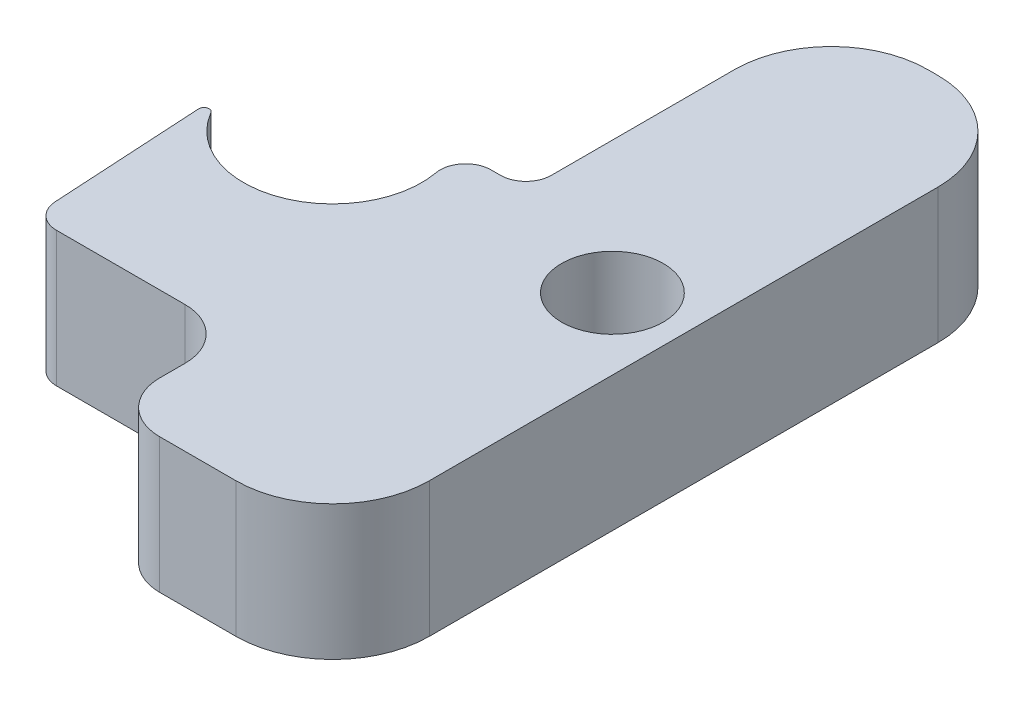
ISO-10303-21;
HEADER;
FILE_DESCRIPTION(('STEP AP214'),'2;1');
FILE_NAME('part.step','',(''),(''),'','','');
FILE_SCHEMA(('AUTOMOTIVE_DESIGN { 1 0 10303 214 1 1 1 1 }'));
ENDSEC;
DATA;
#1=APPLICATION_CONTEXT('core data for automotive mechanical design processes');
#2=APPLICATION_PROTOCOL_DEFINITION('international standard','automotive_design',2000,#1);
#3=PRODUCT_CONTEXT('',#1,'mechanical');
#4=PRODUCT('Part','Part','',(#3));
#5=PRODUCT_RELATED_PRODUCT_CATEGORY('part','',(#4));
#6=PRODUCT_DEFINITION_FORMATION('','',#4);
#7=PRODUCT_DEFINITION_CONTEXT('part definition',#1,'design');
#8=PRODUCT_DEFINITION('design','',#6,#7);
#9=PRODUCT_DEFINITION_SHAPE('','',#8);
#10=(LENGTH_UNIT() NAMED_UNIT(*) SI_UNIT(.MILLI.,.METRE.));
#11=(NAMED_UNIT(*) PLANE_ANGLE_UNIT() SI_UNIT($,.RADIAN.));
#12=(NAMED_UNIT(*) SI_UNIT($,.STERADIAN.) SOLID_ANGLE_UNIT());
#13=UNCERTAINTY_MEASURE_WITH_UNIT(LENGTH_MEASURE(1.E-05),#10,'distance_accuracy_value','');
#14=(GEOMETRIC_REPRESENTATION_CONTEXT(3) GLOBAL_UNCERTAINTY_ASSIGNED_CONTEXT((#13)) GLOBAL_UNIT_ASSIGNED_CONTEXT((#10,
#11,#12)) REPRESENTATION_CONTEXT('',''));
#15=CARTESIAN_POINT('',(0.,0.,0.));
#16=DIRECTION('',(0.,0.,1.));
#17=DIRECTION('',(1.,0.,0.));
#18=AXIS2_PLACEMENT_3D('',#15,#16,#17);
#19=CARTESIAN_POINT('',(0.,2.65,0.));
#20=DIRECTION('',(0.,-1.,0.));
#21=DIRECTION('',(0.,0.,-1.));
#22=AXIS2_PLACEMENT_3D('',#19,#20,#21);
#23=CYLINDRICAL_SURFACE('',#22,1.75);
#24=CARTESIAN_POINT('',(0.,0.,0.));
#25=DIRECTION('',(0.,1.,0.));
#26=DIRECTION('',(0.,0.,1.));
#27=AXIS2_PLACEMENT_3D('',#24,#25,#26);
#28=CIRCLE('',#27,1.75);
#29=CARTESIAN_POINT('',(-1.51282681163303,0.,0.879690308008579));
#30=VERTEX_POINT('',#29);
#31=CARTESIAN_POINT('',(1.72212365309324,0.,-0.311111111111111));
#32=VERTEX_POINT('',#31);
#33=EDGE_CURVE('E259',#30,#32,#28,.T.);
#34=ORIENTED_EDGE('',*,*,#33,.F.);
#35=DIRECTION('',(0.,-1.,0.));
#36=VECTOR('',#35,1.);
#37=CARTESIAN_POINT('',(-1.51282681163303,2.65,0.879690308008579));
#38=LINE('',#37,#36);
#39=CARTESIAN_POINT('',(-1.51282681163303,2.65,0.879690308008579));
#40=VERTEX_POINT('',#39);
#41=EDGE_CURVE('E11',#40,#30,#38,.T.);
#42=ORIENTED_EDGE('',*,*,#41,.F.);
#43=CARTESIAN_POINT('',(0.,2.65,0.));
#44=DIRECTION('',(0.,1.,0.));
#45=DIRECTION('',(0.,0.,1.));
#46=AXIS2_PLACEMENT_3D('',#43,#44,#45);
#47=CIRCLE('',#46,1.75);
#48=CARTESIAN_POINT('',(1.72212365309324,2.65,-0.311111111111111));
#49=VERTEX_POINT('',#48);
#50=EDGE_CURVE('E568',#40,#49,#47,.T.);
#51=ORIENTED_EDGE('',*,*,#50,.T.);
#52=DIRECTION('',(0.,-1.,0.));
#53=VECTOR('',#52,1.);
#54=CARTESIAN_POINT('',(1.72212365309324,2.65,-0.311111111111111));
#55=LINE('',#54,#53);
#56=EDGE_CURVE('E59',#49,#32,#55,.T.);
#57=ORIENTED_EDGE('',*,*,#56,.T.);
#58=EDGE_LOOP('',(#34,#42,#51,#57));
#59=FACE_BOUND('',#58,.T.);
#60=ADVANCED_FACE('F41',(#59),#23,.F.);
#61=CARTESIAN_POINT('',(-1.59927405801206,2.65,0.92995832560907));
#62=DIRECTION('',(0.,-1.,0.));
#63=DIRECTION('',(0.,0.,-1.));
#64=AXIS2_PLACEMENT_3D('',#61,#62,#63);
#65=CYLINDRICAL_SURFACE('',#64,0.1);
#66=CARTESIAN_POINT('',(-1.59927405801206,0.,0.92995832560907));
#67=DIRECTION('',(0.,1.,0.));
#68=DIRECTION('',(0.,0.,1.));
#69=AXIS2_PLACEMENT_3D('',#66,#67,#68);
#70=CIRCLE('',#69,0.1);
#71=CARTESIAN_POINT('',(-1.69910929988495,0.,0.935696311334222));
#72=VERTEX_POINT('',#71);
#73=EDGE_CURVE('E255',#30,#72,#70,.T.);
#74=ORIENTED_EDGE('',*,*,#73,.T.);
#75=DIRECTION('',(0.,-1.,0.));
#76=VECTOR('',#75,1.);
#77=CARTESIAN_POINT('',(-1.69910929988495,2.65,0.935696311334222));
#78=LINE('',#77,#76);
#79=CARTESIAN_POINT('',(-1.69910929988495,2.65,0.935696311334222));
#80=VERTEX_POINT('',#79);
#81=EDGE_CURVE('E51',#80,#72,#78,.T.);
#82=ORIENTED_EDGE('',*,*,#81,.F.);
#83=CARTESIAN_POINT('',(-1.59927405801206,2.65,0.92995832560907));
#84=DIRECTION('',(0.,1.,0.));
#85=DIRECTION('',(0.,0.,1.));
#86=AXIS2_PLACEMENT_3D('',#83,#84,#85);
#87=CIRCLE('',#86,0.1);
#88=EDGE_CURVE('E562',#40,#80,#87,.T.);
#89=ORIENTED_EDGE('',*,*,#88,.F.);
#90=ORIENTED_EDGE('',*,*,#41,.T.);
#91=EDGE_LOOP('',(#74,#82,#89,#90));
#92=FACE_BOUND('',#91,.T.);
#93=ADVANCED_FACE('F256',(#92),#65,.T.);
#94=CARTESIAN_POINT('',(-1.74711673277553,2.65,0.10041475019016));
#95=DIRECTION('',(-0.998352418728875,0.,0.0573798572515198));
#96=DIRECTION('',(0.0573798572515198,0.,0.998352418728875));
#97=AXIS2_PLACEMENT_3D('',#94,#95,#96);
#98=PLANE('',#97);
#99=DIRECTION('',(-0.0573798572515198,0.,-0.998352418728875));
#100=VECTOR('',#99,1.);
#101=CARTESIAN_POINT('',(-1.74711673277553,0.,0.10041475019016));
#102=LINE('',#101,#100);
#103=CARTESIAN_POINT('',(-1.52708833484982,0.,3.92868992862576));
#104=VERTEX_POINT('',#103);
#105=EDGE_CURVE('E249',#104,#72,#102,.T.);
#106=ORIENTED_EDGE('',*,*,#105,.F.);
#107=DIRECTION('',(0.,-1.,0.));
#108=VECTOR('',#107,1.);
#109=CARTESIAN_POINT('',(-1.52708833484982,2.65,3.92868992862576));
#110=LINE('',#109,#108);
#111=CARTESIAN_POINT('',(-1.52708833484982,2.65,3.92868992862576));
#112=VERTEX_POINT('',#111);
#113=EDGE_CURVE('E239',#112,#104,#110,.T.);
#114=ORIENTED_EDGE('',*,*,#113,.F.);
#115=DIRECTION('',(-0.0573798572515198,0.,-0.998352418728875));
#116=VECTOR('',#115,1.);
#117=CARTESIAN_POINT('',(-1.74711673277553,2.65,0.10041475019016));
#118=LINE('',#117,#116);
#119=EDGE_CURVE('E252',#112,#80,#118,.T.);
#120=ORIENTED_EDGE('',*,*,#119,.T.);
#121=ORIENTED_EDGE('',*,*,#81,.T.);
#122=EDGE_LOOP('',(#106,#114,#120,#121));
#123=FACE_BOUND('',#122,.T.);
#124=ADVANCED_FACE('F247',(#123),#98,.T.);
#125=CARTESIAN_POINT('',(-1.02791212548538,2.65,3.9));
#126=DIRECTION('',(0.,-1.,0.));
#127=DIRECTION('',(0.,0.,-1.));
#128=AXIS2_PLACEMENT_3D('',#125,#126,#127);
#129=CYLINDRICAL_SURFACE('',#128,0.5);
#130=CARTESIAN_POINT('',(-1.02791212548538,0.,3.9));
#131=DIRECTION('',(0.,1.,0.));
#132=DIRECTION('',(0.,0.,1.));
#133=AXIS2_PLACEMENT_3D('',#130,#131,#132);
#134=CIRCLE('',#133,0.5);
#135=CARTESIAN_POINT('',(-1.02791212548538,0.,4.4));
#136=VERTEX_POINT('',#135);
#137=EDGE_CURVE('E264',#136,#104,#134,.F.);
#138=ORIENTED_EDGE('',*,*,#137,.F.);
#139=DIRECTION('',(0.,-1.,0.));
#140=VECTOR('',#139,1.);
#141=CARTESIAN_POINT('',(-1.02791212548538,2.65,4.4));
#142=LINE('',#141,#140);
#143=CARTESIAN_POINT('',(-1.02791212548538,2.65,4.4));
#144=VERTEX_POINT('',#143);
#145=EDGE_CURVE('E236',#144,#136,#142,.T.);
#146=ORIENTED_EDGE('',*,*,#145,.F.);
#147=CARTESIAN_POINT('',(-1.02791212548538,2.65,3.9));
#148=DIRECTION('',(0.,1.,0.));
#149=DIRECTION('',(0.,0.,1.));
#150=AXIS2_PLACEMENT_3D('',#147,#148,#149);
#151=CIRCLE('',#150,0.5);
#152=EDGE_CURVE('E561',#144,#112,#151,.F.);
#153=ORIENTED_EDGE('',*,*,#152,.T.);
#154=ORIENTED_EDGE('',*,*,#113,.T.);
#155=EDGE_LOOP('',(#138,#146,#153,#154));
#156=FACE_BOUND('',#155,.T.);
#157=ADVANCED_FACE('F352',(#156),#129,.T.);
#158=CARTESIAN_POINT('',(0.,2.65,4.4));
#159=DIRECTION('',(0.,0.,-1.));
#160=DIRECTION('',(-1.,0.,0.));
#161=AXIS2_PLACEMENT_3D('',#158,#159,#160);
#162=PLANE('',#161);
#163=DIRECTION('',(1.,0.,0.));
#164=VECTOR('',#163,1.);
#165=CARTESIAN_POINT('',(0.,0.,4.4));
#166=LINE('',#165,#164);
#167=CARTESIAN_POINT('',(1.49999999999999,0.,4.4));
#168=VERTEX_POINT('',#167);
#169=EDGE_CURVE('E268',#136,#168,#166,.T.);
#170=ORIENTED_EDGE('',*,*,#169,.T.);
#171=DIRECTION('',(0.,-1.,0.));
#172=VECTOR('',#171,1.);
#173=CARTESIAN_POINT('',(1.49999999999999,2.65,4.4));
#174=LINE('',#173,#172);
#175=CARTESIAN_POINT('',(1.49999999999999,2.65,4.4));
#176=VERTEX_POINT('',#175);
#177=EDGE_CURVE('E232',#176,#168,#174,.T.);
#178=ORIENTED_EDGE('',*,*,#177,.F.);
#179=DIRECTION('',(1.,0.,0.));
#180=VECTOR('',#179,1.);
#181=CARTESIAN_POINT('',(0.,2.65,4.4));
#182=LINE('',#181,#180);
#183=EDGE_CURVE('E558',#144,#176,#182,.T.);
#184=ORIENTED_EDGE('',*,*,#183,.F.);
#185=ORIENTED_EDGE('',*,*,#145,.T.);
#186=EDGE_LOOP('',(#170,#178,#184,#185));
#187=FACE_BOUND('',#186,.T.);
#188=ADVANCED_FACE('F355',(#187),#162,.F.);
#189=CARTESIAN_POINT('',(1.5,2.65,5.4));
#190=DIRECTION('',(0.,-1.,0.));
#191=DIRECTION('',(0.,0.,-1.));
#192=AXIS2_PLACEMENT_3D('',#189,#190,#191);
#193=CYLINDRICAL_SURFACE('',#192,1.);
#194=CARTESIAN_POINT('',(1.5,0.,5.4));
#195=DIRECTION('',(0.,1.,0.));
#196=DIRECTION('',(0.,0.,1.));
#197=AXIS2_PLACEMENT_3D('',#194,#195,#196);
#198=CIRCLE('',#197,1.);
#199=CARTESIAN_POINT('',(2.5,0.,5.40000000000001));
#200=VERTEX_POINT('',#199);
#201=EDGE_CURVE('E275',#168,#200,#198,.F.);
#202=ORIENTED_EDGE('',*,*,#201,.T.);
#203=DIRECTION('',(0.,-1.,0.));
#204=VECTOR('',#203,1.);
#205=CARTESIAN_POINT('',(2.5,2.65,5.40000000000001));
#206=LINE('',#205,#204);
#207=CARTESIAN_POINT('',(2.5,2.65,5.40000000000001));
#208=VERTEX_POINT('',#207);
#209=EDGE_CURVE('E228',#208,#200,#206,.T.);
#210=ORIENTED_EDGE('',*,*,#209,.F.);
#211=CARTESIAN_POINT('',(1.5,2.65,5.4));
#212=DIRECTION('',(0.,1.,0.));
#213=DIRECTION('',(0.,0.,1.));
#214=AXIS2_PLACEMENT_3D('',#211,#212,#213);
#215=CIRCLE('',#214,1.);
#216=EDGE_CURVE('E555',#176,#208,#215,.F.);
#217=ORIENTED_EDGE('',*,*,#216,.F.);
#218=ORIENTED_EDGE('',*,*,#177,.T.);
#219=EDGE_LOOP('',(#202,#210,#217,#218));
#220=FACE_BOUND('',#219,.T.);
#221=ADVANCED_FACE('F359',(#220),#193,.F.);
#222=CARTESIAN_POINT('',(2.5,2.65,0.));
#223=DIRECTION('',(1.,0.,0.));
#224=DIRECTION('',(0.,0.,-1.));
#225=AXIS2_PLACEMENT_3D('',#222,#223,#224);
#226=PLANE('',#225);
#227=DIRECTION('',(0.,0.,1.));
#228=VECTOR('',#227,1.);
#229=CARTESIAN_POINT('',(2.5,0.,0.));
#230=LINE('',#229,#228);
#231=CARTESIAN_POINT('',(2.5,0.,5.9));
#232=VERTEX_POINT('',#231);
#233=EDGE_CURVE('E279',#200,#232,#230,.T.);
#234=ORIENTED_EDGE('',*,*,#233,.T.);
#235=DIRECTION('',(0.,-1.,0.));
#236=VECTOR('',#235,1.);
#237=CARTESIAN_POINT('',(2.5,2.65,5.9));
#238=LINE('',#237,#236);
#239=CARTESIAN_POINT('',(2.5,2.65,5.9));
#240=VERTEX_POINT('',#239);
#241=EDGE_CURVE('E225',#240,#232,#238,.T.);
#242=ORIENTED_EDGE('',*,*,#241,.F.);
#243=DIRECTION('',(0.,0.,1.));
#244=VECTOR('',#243,1.);
#245=CARTESIAN_POINT('',(2.5,2.65,0.));
#246=LINE('',#245,#244);
#247=EDGE_CURVE('E576',#208,#240,#246,.T.);
#248=ORIENTED_EDGE('',*,*,#247,.F.);
#249=ORIENTED_EDGE('',*,*,#209,.T.);
#250=EDGE_LOOP('',(#234,#242,#248,#249));
#251=FACE_BOUND('',#250,.T.);
#252=ADVANCED_FACE('F363',(#251),#226,.F.);
#253=CARTESIAN_POINT('',(3.5,2.65,5.9));
#254=DIRECTION('',(0.,-1.,0.));
#255=DIRECTION('',(0.,0.,-1.));
#256=AXIS2_PLACEMENT_3D('',#253,#254,#255);
#257=CYLINDRICAL_SURFACE('',#256,1.);
#258=CARTESIAN_POINT('',(3.5,0.,5.9));
#259=DIRECTION('',(0.,1.,0.));
#260=DIRECTION('',(0.,0.,1.));
#261=AXIS2_PLACEMENT_3D('',#258,#259,#260);
#262=CIRCLE('',#261,1.);
#263=CARTESIAN_POINT('',(3.50000000000001,0.,6.9));
#264=VERTEX_POINT('',#263);
#265=EDGE_CURVE('E283',#264,#232,#262,.F.);
#266=ORIENTED_EDGE('',*,*,#265,.F.);
#267=DIRECTION('',(0.,-1.,0.));
#268=VECTOR('',#267,1.);
#269=CARTESIAN_POINT('',(3.50000000000001,2.65,6.9));
#270=LINE('',#269,#268);
#271=CARTESIAN_POINT('',(3.50000000000001,2.65,6.9));
#272=VERTEX_POINT('',#271);
#273=EDGE_CURVE('E222',#272,#264,#270,.T.);
#274=ORIENTED_EDGE('',*,*,#273,.F.);
#275=CARTESIAN_POINT('',(3.5,2.65,5.9));
#276=DIRECTION('',(0.,1.,0.));
#277=DIRECTION('',(0.,0.,1.));
#278=AXIS2_PLACEMENT_3D('',#275,#276,#277);
#279=CIRCLE('',#278,1.);
#280=EDGE_CURVE('E551',#272,#240,#279,.F.);
#281=ORIENTED_EDGE('',*,*,#280,.T.);
#282=ORIENTED_EDGE('',*,*,#241,.T.);
#283=EDGE_LOOP('',(#266,#274,#281,#282));
#284=FACE_BOUND('',#283,.T.);
#285=ADVANCED_FACE('F367',(#284),#257,.T.);
#286=CARTESIAN_POINT('',(0.,2.65,6.9));
#287=DIRECTION('',(0.,0.,-1.));
#288=DIRECTION('',(-1.,0.,0.));
#289=AXIS2_PLACEMENT_3D('',#286,#287,#288);
#290=PLANE('',#289);
#291=DIRECTION('',(1.,0.,0.));
#292=VECTOR('',#291,1.);
#293=CARTESIAN_POINT('',(0.,0.,6.9));
#294=LINE('',#293,#292);
#295=CARTESIAN_POINT('',(4.99999999999999,0.,6.9));
#296=VERTEX_POINT('',#295);
#297=EDGE_CURVE('E287',#264,#296,#294,.T.);
#298=ORIENTED_EDGE('',*,*,#297,.T.);
#299=DIRECTION('',(0.,-1.,0.));
#300=VECTOR('',#299,1.);
#301=CARTESIAN_POINT('',(4.99999999999999,2.65,6.9));
#302=LINE('',#301,#300);
#303=CARTESIAN_POINT('',(4.99999999999999,2.65,6.9));
#304=VERTEX_POINT('',#303);
#305=EDGE_CURVE('E218',#304,#296,#302,.T.);
#306=ORIENTED_EDGE('',*,*,#305,.F.);
#307=DIRECTION('',(1.,0.,0.));
#308=VECTOR('',#307,1.);
#309=CARTESIAN_POINT('',(0.,2.65,6.9));
#310=LINE('',#309,#308);
#311=EDGE_CURVE('E581',#272,#304,#310,.T.);
#312=ORIENTED_EDGE('',*,*,#311,.F.);
#313=ORIENTED_EDGE('',*,*,#273,.T.);
#314=EDGE_LOOP('',(#298,#306,#312,#313));
#315=FACE_BOUND('',#314,.T.);
#316=ADVANCED_FACE('F371',(#315),#290,.F.);
#317=CARTESIAN_POINT('',(5.,2.65,5.));
#318=DIRECTION('',(0.,-1.,0.));
#319=DIRECTION('',(0.,0.,-1.));
#320=AXIS2_PLACEMENT_3D('',#317,#318,#319);
#321=CYLINDRICAL_SURFACE('',#320,1.9);
#322=CARTESIAN_POINT('',(5.,0.,5.));
#323=DIRECTION('',(0.,1.,0.));
#324=DIRECTION('',(0.,0.,1.));
#325=AXIS2_PLACEMENT_3D('',#322,#323,#324);
#326=CIRCLE('',#325,1.9);
#327=CARTESIAN_POINT('',(6.9,0.,4.99999999999999));
#328=VERTEX_POINT('',#327);
#329=EDGE_CURVE('E291',#296,#328,#326,.T.);
#330=ORIENTED_EDGE('',*,*,#329,.T.);
#331=DIRECTION('',(0.,-1.,0.));
#332=VECTOR('',#331,1.);
#333=CARTESIAN_POINT('',(6.9,2.65,4.99999999999999));
#334=LINE('',#333,#332);
#335=CARTESIAN_POINT('',(6.9,2.65,4.99999999999999));
#336=VERTEX_POINT('',#335);
#337=EDGE_CURVE('E215',#336,#328,#334,.T.);
#338=ORIENTED_EDGE('',*,*,#337,.F.);
#339=CARTESIAN_POINT('',(5.,2.65,5.));
#340=DIRECTION('',(0.,1.,0.));
#341=DIRECTION('',(0.,0.,1.));
#342=AXIS2_PLACEMENT_3D('',#339,#340,#341);
#343=CIRCLE('',#342,1.9);
#344=EDGE_CURVE('E585',#304,#336,#343,.T.);
#345=ORIENTED_EDGE('',*,*,#344,.F.);
#346=ORIENTED_EDGE('',*,*,#305,.T.);
#347=EDGE_LOOP('',(#330,#338,#345,#346));
#348=FACE_BOUND('',#347,.T.);
#349=ADVANCED_FACE('F375',(#348),#321,.T.);
#350=CARTESIAN_POINT('',(6.9,2.65,0.));
#351=DIRECTION('',(1.,0.,0.));
#352=DIRECTION('',(0.,0.,-1.));
#353=AXIS2_PLACEMENT_3D('',#350,#351,#352);
#354=PLANE('',#353);
#355=DIRECTION('',(0.,0.,1.));
#356=VECTOR('',#355,1.);
#357=CARTESIAN_POINT('',(6.9,0.,0.));
#358=LINE('',#357,#356);
#359=CARTESIAN_POINT('',(6.9,0.,-4.99999999999999));
#360=VERTEX_POINT('',#359);
#361=EDGE_CURVE('E295',#360,#328,#358,.T.);
#362=ORIENTED_EDGE('',*,*,#361,.F.);
#363=DIRECTION('',(0.,-1.,0.));
#364=VECTOR('',#363,1.);
#365=CARTESIAN_POINT('',(6.9,2.65,-4.99999999999999));
#366=LINE('',#365,#364);
#367=CARTESIAN_POINT('',(6.9,2.65,-4.99999999999999));
#368=VERTEX_POINT('',#367);
#369=EDGE_CURVE('E212',#368,#360,#366,.T.);
#370=ORIENTED_EDGE('',*,*,#369,.F.);
#371=DIRECTION('',(0.,0.,1.));
#372=VECTOR('',#371,1.);
#373=CARTESIAN_POINT('',(6.9,2.65,0.));
#374=LINE('',#373,#372);
#375=EDGE_CURVE('E543',#368,#336,#374,.T.);
#376=ORIENTED_EDGE('',*,*,#375,.T.);
#377=ORIENTED_EDGE('',*,*,#337,.T.);
#378=EDGE_LOOP('',(#362,#370,#376,#377));
#379=FACE_BOUND('',#378,.T.);
#380=ADVANCED_FACE('F379',(#379),#354,.T.);
#381=CARTESIAN_POINT('',(5.,2.65,-5.));
#382=DIRECTION('',(0.,-1.,0.));
#383=DIRECTION('',(0.,0.,-1.));
#384=AXIS2_PLACEMENT_3D('',#381,#382,#383);
#385=CYLINDRICAL_SURFACE('',#384,1.9);
#386=CARTESIAN_POINT('',(5.,0.,-5.));
#387=DIRECTION('',(0.,1.,0.));
#388=DIRECTION('',(0.,0.,1.));
#389=AXIS2_PLACEMENT_3D('',#386,#387,#388);
#390=CIRCLE('',#389,1.9);
#391=CARTESIAN_POINT('',(4.99999999999999,0.,-6.9));
#392=VERTEX_POINT('',#391);
#393=EDGE_CURVE('E299',#392,#360,#390,.F.);
#394=ORIENTED_EDGE('',*,*,#393,.F.);
#395=DIRECTION('',(0.,-1.,0.));
#396=VECTOR('',#395,1.);
#397=CARTESIAN_POINT('',(4.99999999999999,2.65,-6.9));
#398=LINE('',#397,#396);
#399=CARTESIAN_POINT('',(4.99999999999999,2.65,-6.9));
#400=VERTEX_POINT('',#399);
#401=EDGE_CURVE('E209',#400,#392,#398,.T.);
#402=ORIENTED_EDGE('',*,*,#401,.F.);
#403=CARTESIAN_POINT('',(5.,2.65,-5.));
#404=DIRECTION('',(0.,1.,0.));
#405=DIRECTION('',(0.,0.,1.));
#406=AXIS2_PLACEMENT_3D('',#403,#404,#405);
#407=CIRCLE('',#406,1.9);
#408=EDGE_CURVE('E539',#400,#368,#407,.F.);
#409=ORIENTED_EDGE('',*,*,#408,.T.);
#410=ORIENTED_EDGE('',*,*,#369,.T.);
#411=EDGE_LOOP('',(#394,#402,#409,#410));
#412=FACE_BOUND('',#411,.T.);
#413=ADVANCED_FACE('F383',(#412),#385,.T.);
#414=CARTESIAN_POINT('',(0.,2.65,-6.9));
#415=DIRECTION('',(0.,0.,-1.));
#416=DIRECTION('',(-1.,0.,0.));
#417=AXIS2_PLACEMENT_3D('',#414,#415,#416);
#418=PLANE('',#417);
#419=DIRECTION('',(1.,0.,0.));
#420=VECTOR('',#419,1.);
#421=CARTESIAN_POINT('',(0.,0.,-6.9));
#422=LINE('',#421,#420);
#423=CARTESIAN_POINT('',(4.80000000000001,0.,-6.9));
#424=VERTEX_POINT('',#423);
#425=EDGE_CURVE('E303',#424,#392,#422,.T.);
#426=ORIENTED_EDGE('',*,*,#425,.F.);
#427=DIRECTION('',(0.,-1.,0.));
#428=VECTOR('',#427,1.);
#429=CARTESIAN_POINT('',(4.80000000000001,2.65,-6.9));
#430=LINE('',#429,#428);
#431=CARTESIAN_POINT('',(4.80000000000001,2.65,-6.9));
#432=VERTEX_POINT('',#431);
#433=EDGE_CURVE('E206',#432,#424,#430,.T.);
#434=ORIENTED_EDGE('',*,*,#433,.F.);
#435=DIRECTION('',(1.,0.,0.));
#436=VECTOR('',#435,1.);
#437=CARTESIAN_POINT('',(0.,2.65,-6.9));
#438=LINE('',#437,#436);
#439=EDGE_CURVE('E592',#432,#400,#438,.T.);
#440=ORIENTED_EDGE('',*,*,#439,.T.);
#441=ORIENTED_EDGE('',*,*,#401,.T.);
#442=EDGE_LOOP('',(#426,#434,#440,#441));
#443=FACE_BOUND('',#442,.T.);
#444=ADVANCED_FACE('F387',(#443),#418,.T.);
#445=CARTESIAN_POINT('',(4.8,2.65,-5.));
#446=DIRECTION('',(0.,-1.,0.));
#447=DIRECTION('',(0.,0.,-1.));
#448=AXIS2_PLACEMENT_3D('',#445,#446,#447);
#449=CYLINDRICAL_SURFACE('',#448,1.9);
#450=CARTESIAN_POINT('',(4.8,0.,-5.));
#451=DIRECTION('',(0.,1.,0.));
#452=DIRECTION('',(0.,0.,1.));
#453=AXIS2_PLACEMENT_3D('',#450,#451,#452);
#454=CIRCLE('',#453,1.9);
#455=CARTESIAN_POINT('',(2.9,0.,-4.99999999999999));
#456=VERTEX_POINT('',#455);
#457=EDGE_CURVE('E307',#456,#424,#454,.F.);
#458=ORIENTED_EDGE('',*,*,#457,.F.);
#459=DIRECTION('',(0.,-1.,0.));
#460=VECTOR('',#459,1.);
#461=CARTESIAN_POINT('',(2.9,2.65,-4.99999999999999));
#462=LINE('',#461,#460);
#463=CARTESIAN_POINT('',(2.9,2.65,-4.99999999999999));
#464=VERTEX_POINT('',#463);
#465=EDGE_CURVE('E199',#464,#456,#462,.T.);
#466=ORIENTED_EDGE('',*,*,#465,.F.);
#467=CARTESIAN_POINT('',(4.8,2.65,-5.));
#468=DIRECTION('',(0.,1.,0.));
#469=DIRECTION('',(0.,0.,1.));
#470=AXIS2_PLACEMENT_3D('',#467,#468,#469);
#471=CIRCLE('',#470,1.9);
#472=EDGE_CURVE('E532',#464,#432,#471,.F.);
#473=ORIENTED_EDGE('',*,*,#472,.T.);
#474=ORIENTED_EDGE('',*,*,#433,.T.);
#475=EDGE_LOOP('',(#458,#466,#473,#474));
#476=FACE_BOUND('',#475,.T.);
#477=ADVANCED_FACE('F391',(#476),#449,.T.);
#478=CARTESIAN_POINT('',(2.9,2.65,0.));
#479=DIRECTION('',(1.,0.,0.));
#480=DIRECTION('',(0.,0.,-1.));
#481=AXIS2_PLACEMENT_3D('',#478,#479,#480);
#482=PLANE('',#481);
#483=DIRECTION('',(0.,0.,1.));
#484=VECTOR('',#483,1.);
#485=CARTESIAN_POINT('',(2.9,0.,0.));
#486=LINE('',#485,#484);
#487=CARTESIAN_POINT('',(2.9,0.,-1.4));
#488=VERTEX_POINT('',#487);
#489=EDGE_CURVE('E311',#456,#488,#486,.T.);
#490=ORIENTED_EDGE('',*,*,#489,.T.);
#491=DIRECTION('',(0.,-1.,0.));
#492=VECTOR('',#491,1.);
#493=CARTESIAN_POINT('',(2.9,2.65,-1.4));
#494=LINE('',#493,#492);
#495=CARTESIAN_POINT('',(2.9,2.65,-1.4));
#496=VERTEX_POINT('',#495);
#497=EDGE_CURVE('E195',#496,#488,#494,.T.);
#498=ORIENTED_EDGE('',*,*,#497,.F.);
#499=DIRECTION('',(0.,0.,1.));
#500=VECTOR('',#499,1.);
#501=CARTESIAN_POINT('',(2.9,2.65,0.));
#502=LINE('',#501,#500);
#503=EDGE_CURVE('E186',#464,#496,#502,.T.);
#504=ORIENTED_EDGE('',*,*,#503,.F.);
#505=ORIENTED_EDGE('',*,*,#465,.T.);
#506=EDGE_LOOP('',(#490,#498,#504,#505));
#507=FACE_BOUND('',#506,.T.);
#508=ADVANCED_FACE('F395',(#507),#482,.F.);
#509=CARTESIAN_POINT('',(2.4,2.65,-1.4));
#510=DIRECTION('',(0.,-1.,0.));
#511=DIRECTION('',(0.,0.,-1.));
#512=AXIS2_PLACEMENT_3D('',#509,#510,#511);
#513=CYLINDRICAL_SURFACE('',#512,0.5);
#514=CARTESIAN_POINT('',(2.4,0.,-1.4));
#515=DIRECTION('',(0.,1.,0.));
#516=DIRECTION('',(0.,0.,1.));
#517=AXIS2_PLACEMENT_3D('',#514,#515,#516);
#518=CIRCLE('',#517,0.5);
#519=CARTESIAN_POINT('',(2.4,0.,-0.899999999999999));
#520=VERTEX_POINT('',#519);
#521=EDGE_CURVE('E193',#488,#520,#518,.F.);
#522=ORIENTED_EDGE('',*,*,#521,.T.);
#523=DIRECTION('',(0.,-1.,0.));
#524=VECTOR('',#523,1.);
#525=CARTESIAN_POINT('',(2.4,2.65,-0.899999999999999));
#526=LINE('',#525,#524);
#527=CARTESIAN_POINT('',(2.4,2.65,-0.899999999999999));
#528=VERTEX_POINT('',#527);
#529=EDGE_CURVE('E173',#528,#520,#526,.T.);
#530=ORIENTED_EDGE('',*,*,#529,.F.);
#531=CARTESIAN_POINT('',(2.4,2.65,-1.4));
#532=DIRECTION('',(0.,1.,0.));
#533=DIRECTION('',(0.,0.,1.));
#534=AXIS2_PLACEMENT_3D('',#531,#532,#533);
#535=CIRCLE('',#534,0.5);
#536=EDGE_CURVE('E179',#496,#528,#535,.F.);
#537=ORIENTED_EDGE('',*,*,#536,.F.);
#538=ORIENTED_EDGE('',*,*,#497,.T.);
#539=EDGE_LOOP('',(#522,#530,#537,#538));
#540=FACE_BOUND('',#539,.T.);
#541=ADVANCED_FACE('F192',(#540),#513,.F.);
#542=CARTESIAN_POINT('',(0.,2.65,-0.900000000000004));
#543=DIRECTION('',(0.,0.,1.));
#544=DIRECTION('',(1.,0.,0.));
#545=AXIS2_PLACEMENT_3D('',#542,#543,#544);
#546=PLANE('',#545);
#547=DIRECTION('',(-1.,0.,0.));
#548=VECTOR('',#547,1.);
#549=CARTESIAN_POINT('',(0.,0.,-0.900000000000004));
#550=LINE('',#549,#548);
#551=CARTESIAN_POINT('',(2.21415898254845,0.,-0.899999999999999));
#552=VERTEX_POINT('',#551);
#553=EDGE_CURVE('E317',#520,#552,#550,.T.);
#554=ORIENTED_EDGE('',*,*,#553,.T.);
#555=DIRECTION('',(0.,-1.,0.));
#556=VECTOR('',#555,1.);
#557=CARTESIAN_POINT('',(2.21415898254845,2.65,-0.899999999999999));
#558=LINE('',#557,#556);
#559=CARTESIAN_POINT('',(2.21415898254845,2.65,-0.899999999999999));
#560=VERTEX_POINT('',#559);
#561=EDGE_CURVE('E115',#560,#552,#558,.T.);
#562=ORIENTED_EDGE('',*,*,#561,.F.);
#563=DIRECTION('',(-1.,0.,0.));
#564=VECTOR('',#563,1.);
#565=CARTESIAN_POINT('',(0.,2.65,-0.900000000000004));
#566=LINE('',#565,#564);
#567=EDGE_CURVE('E169',#528,#560,#566,.T.);
#568=ORIENTED_EDGE('',*,*,#567,.F.);
#569=ORIENTED_EDGE('',*,*,#529,.T.);
#570=EDGE_LOOP('',(#554,#562,#568,#569));
#571=FACE_BOUND('',#570,.T.);
#572=ADVANCED_FACE('F171',(#571),#546,.F.);
#573=CARTESIAN_POINT('',(5.5,2.65,0.));
#574=DIRECTION('',(0.,-1.,0.));
#575=DIRECTION('',(0.,0.,-1.));
#576=AXIS2_PLACEMENT_3D('',#573,#574,#575);
#577=CYLINDRICAL_SURFACE('',#576,1.);
#578=CARTESIAN_POINT('',(5.5,2.65,0.));
#579=DIRECTION('',(0.,1.,0.));
#580=DIRECTION('',(0.,0.,1.));
#581=AXIS2_PLACEMENT_3D('',#578,#579,#580);
#582=CIRCLE('',#581,1.);
#583=CARTESIAN_POINT('',(5.5,2.65,0.999999999999999));
#584=VERTEX_POINT('',#583);
#585=EDGE_CURVE('E323',#584,#584,#582,.T.);
#586=ORIENTED_EDGE('',*,*,#585,.T.);
#587=EDGE_LOOP('',(#586));
#588=FACE_BOUND('',#587,.T.);
#589=CARTESIAN_POINT('',(5.5,0.,0.));
#590=DIRECTION('',(0.,1.,0.));
#591=DIRECTION('',(0.,0.,1.));
#592=AXIS2_PLACEMENT_3D('',#589,#590,#591);
#593=CIRCLE('',#592,1.);
#594=CARTESIAN_POINT('',(5.5,0.,0.999999999999999));
#595=VERTEX_POINT('',#594);
#596=EDGE_CURVE('E328',#595,#595,#593,.T.);
#597=ORIENTED_EDGE('',*,*,#596,.F.);
#598=EDGE_LOOP('',(#597));
#599=FACE_BOUND('',#598,.T.);
#600=ADVANCED_FACE('F43',(#588,#599),#577,.F.);
#601=CARTESIAN_POINT('',(2.21415898254845,2.65,-0.399999999999999));
#602=DIRECTION('',(0.,-1.,0.));
#603=DIRECTION('',(0.,0.,-1.));
#604=AXIS2_PLACEMENT_3D('',#601,#602,#603);
#605=CYLINDRICAL_SURFACE('',#604,0.5);
#606=CARTESIAN_POINT('',(2.21415898254845,0.,-0.399999999999999));
#607=DIRECTION('',(0.,1.,0.));
#608=DIRECTION('',(0.,0.,1.));
#609=AXIS2_PLACEMENT_3D('',#606,#607,#608);
#610=CIRCLE('',#609,0.5);
#611=EDGE_CURVE('E320',#32,#552,#610,.F.);
#612=ORIENTED_EDGE('',*,*,#611,.F.);
#613=ORIENTED_EDGE('',*,*,#56,.F.);
#614=CARTESIAN_POINT('',(2.21415898254845,2.65,-0.399999999999999));
#615=DIRECTION('',(0.,1.,0.));
#616=DIRECTION('',(0.,0.,1.));
#617=AXIS2_PLACEMENT_3D('',#614,#615,#616);
#618=CIRCLE('',#617,0.5);
#619=EDGE_CURVE('E178',#49,#560,#618,.F.);
#620=ORIENTED_EDGE('',*,*,#619,.T.);
#621=ORIENTED_EDGE('',*,*,#561,.T.);
#622=EDGE_LOOP('',(#612,#613,#620,#621));
#623=FACE_BOUND('',#622,.T.);
#624=ADVANCED_FACE('F332',(#623),#605,.T.);
#625=CARTESIAN_POINT('',(0.,2.65,0.));
#626=DIRECTION('',(0.,1.,0.));
#627=DIRECTION('',(0.,0.,1.));
#628=AXIS2_PLACEMENT_3D('',#625,#626,#627);
#629=PLANE('',#628);
#630=ORIENTED_EDGE('',*,*,#585,.F.);
#631=EDGE_LOOP('',(#630));
#632=FACE_BOUND('',#631,.T.);
#633=ORIENTED_EDGE('',*,*,#50,.F.);
#634=ORIENTED_EDGE('',*,*,#88,.T.);
#635=ORIENTED_EDGE('',*,*,#119,.F.);
#636=ORIENTED_EDGE('',*,*,#152,.F.);
#637=ORIENTED_EDGE('',*,*,#183,.T.);
#638=ORIENTED_EDGE('',*,*,#216,.T.);
#639=ORIENTED_EDGE('',*,*,#247,.T.);
#640=ORIENTED_EDGE('',*,*,#280,.F.);
#641=ORIENTED_EDGE('',*,*,#311,.T.);
#642=ORIENTED_EDGE('',*,*,#344,.T.);
#643=ORIENTED_EDGE('',*,*,#375,.F.);
#644=ORIENTED_EDGE('',*,*,#408,.F.);
#645=ORIENTED_EDGE('',*,*,#439,.F.);
#646=ORIENTED_EDGE('',*,*,#472,.F.);
#647=ORIENTED_EDGE('',*,*,#503,.T.);
#648=ORIENTED_EDGE('',*,*,#536,.T.);
#649=ORIENTED_EDGE('',*,*,#567,.T.);
#650=ORIENTED_EDGE('',*,*,#619,.F.);
#651=EDGE_LOOP('',(#633,#634,#635,#636,#637,#638,#639,#640,#641,#642,#643,#644,#645,#646,#647,
#648,#649,#650));
#652=FACE_BOUND('',#651,.T.);
#653=ADVANCED_FACE('F183',(#632,#652),#629,.T.);
#654=CARTESIAN_POINT('',(0.,0.,0.));
#655=DIRECTION('',(0.,1.,0.));
#656=DIRECTION('',(0.,0.,1.));
#657=AXIS2_PLACEMENT_3D('',#654,#655,#656);
#658=PLANE('',#657);
#659=ORIENTED_EDGE('',*,*,#596,.T.);
#660=EDGE_LOOP('',(#659));
#661=FACE_BOUND('',#660,.T.);
#662=ORIENTED_EDGE('',*,*,#33,.T.);
#663=ORIENTED_EDGE('',*,*,#611,.T.);
#664=ORIENTED_EDGE('',*,*,#553,.F.);
#665=ORIENTED_EDGE('',*,*,#521,.F.);
#666=ORIENTED_EDGE('',*,*,#489,.F.);
#667=ORIENTED_EDGE('',*,*,#457,.T.);
#668=ORIENTED_EDGE('',*,*,#425,.T.);
#669=ORIENTED_EDGE('',*,*,#393,.T.);
#670=ORIENTED_EDGE('',*,*,#361,.T.);
#671=ORIENTED_EDGE('',*,*,#329,.F.);
#672=ORIENTED_EDGE('',*,*,#297,.F.);
#673=ORIENTED_EDGE('',*,*,#265,.T.);
#674=ORIENTED_EDGE('',*,*,#233,.F.);
#675=ORIENTED_EDGE('',*,*,#201,.F.);
#676=ORIENTED_EDGE('',*,*,#169,.F.);
#677=ORIENTED_EDGE('',*,*,#137,.T.);
#678=ORIENTED_EDGE('',*,*,#105,.T.);
#679=ORIENTED_EDGE('',*,*,#73,.F.);
#680=EDGE_LOOP('',(#662,#663,#664,#665,#666,#667,#668,#669,#670,#671,#672,#673,#674,#675,#676,
#677,#678,#679));
#681=FACE_BOUND('',#680,.T.);
#682=ADVANCED_FACE('F261',(#661,#681),#658,.F.);
#683=CLOSED_SHELL('',(#60,#93,#124,#157,#188,#221,#252,#285,#316,#349,#380,#413,#444,#477,#508,
#541,#572,#600,#624,#653,#682));
#684=MANIFOLD_SOLID_BREP('B2',#683);
#685=ADVANCED_BREP_SHAPE_REPRESENTATION('',(#18,#684),#14);
#686=SHAPE_DEFINITION_REPRESENTATION(#9,#685);
ENDSEC;
END-ISO-10303-21;
